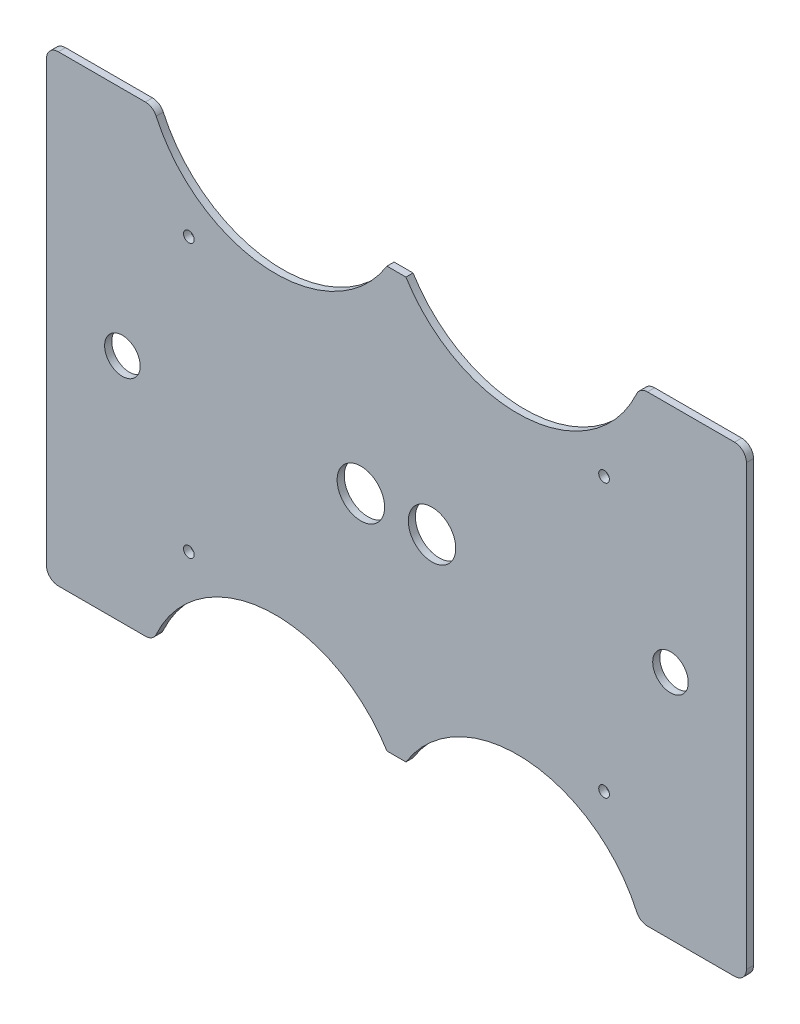
ISO-10303-21;
HEADER;
FILE_DESCRIPTION(('STEP AP214'),'2;1');
FILE_NAME('part.step','',(''),(''),'','','');
FILE_SCHEMA(('AUTOMOTIVE_DESIGN { 1 0 10303 214 1 1 1 1 }'));
ENDSEC;
DATA;
#1=APPLICATION_CONTEXT('core data for automotive mechanical design processes');
#2=APPLICATION_PROTOCOL_DEFINITION('international standard','automotive_design',2000,#1);
#3=PRODUCT_CONTEXT('',#1,'mechanical');
#4=PRODUCT('Part','Part','',(#3));
#5=PRODUCT_RELATED_PRODUCT_CATEGORY('part','',(#4));
#6=PRODUCT_DEFINITION_FORMATION('','',#4);
#7=PRODUCT_DEFINITION_CONTEXT('part definition',#1,'design');
#8=PRODUCT_DEFINITION('design','',#6,#7);
#9=PRODUCT_DEFINITION_SHAPE('','',#8);
#10=(LENGTH_UNIT() NAMED_UNIT(*) SI_UNIT(.MILLI.,.METRE.));
#11=(NAMED_UNIT(*) PLANE_ANGLE_UNIT() SI_UNIT($,.RADIAN.));
#12=(NAMED_UNIT(*) SI_UNIT($,.STERADIAN.) SOLID_ANGLE_UNIT());
#13=UNCERTAINTY_MEASURE_WITH_UNIT(LENGTH_MEASURE(1.E-05),#10,'distance_accuracy_value','');
#14=(GEOMETRIC_REPRESENTATION_CONTEXT(3) GLOBAL_UNCERTAINTY_ASSIGNED_CONTEXT((#13)) GLOBAL_UNIT_ASSIGNED_CONTEXT((#10,
#11,#12)) REPRESENTATION_CONTEXT('',''));
#15=CARTESIAN_POINT('',(0.,0.,0.));
#16=DIRECTION('',(0.,0.,1.));
#17=DIRECTION('',(1.,0.,0.));
#18=AXIS2_PLACEMENT_3D('',#15,#16,#17);
#19=CARTESIAN_POINT('',(198.511421319797,-215.,3.));
#20=DIRECTION('',(0.,0.,-1.));
#21=DIRECTION('',(-1.,0.,0.));
#22=AXIS2_PLACEMENT_3D('',#19,#20,#21);
#23=PLANE('',#22);
#24=CARTESIAN_POINT('',(235.,-155.,3.));
#25=DIRECTION('',(0.,0.,1.));
#26=DIRECTION('',(1.,0.,0.));
#27=AXIS2_PLACEMENT_3D('',#24,#25,#26);
#28=CIRCLE('',#27,2.25000000000001);
#29=CARTESIAN_POINT('',(237.25,-155.,3.));
#30=VERTEX_POINT('',#29);
#31=EDGE_CURVE('E409',#30,#30,#28,.T.);
#32=ORIENTED_EDGE('',*,*,#31,.F.);
#33=EDGE_LOOP('',(#32));
#34=FACE_BOUND('',#33,.T.);
#35=CARTESIAN_POINT('',(162.5,-97.5,3.));
#36=DIRECTION('',(0.,0.,1.));
#37=DIRECTION('',(-1.,0.,0.));
#38=AXIS2_PLACEMENT_3D('',#35,#36,#37);
#39=CIRCLE('',#38,10.);
#40=CARTESIAN_POINT('',(152.5,-97.5,3.));
#41=VERTEX_POINT('',#40);
#42=EDGE_CURVE('E421',#41,#41,#39,.T.);
#43=ORIENTED_EDGE('',*,*,#42,.F.);
#44=EDGE_LOOP('',(#43));
#45=FACE_BOUND('',#44,.T.);
#46=CARTESIAN_POINT('',(263.,-97.5,3.));
#47=DIRECTION('',(0.,0.,1.));
#48=DIRECTION('',(-1.,0.,0.));
#49=AXIS2_PLACEMENT_3D('',#46,#47,#48);
#50=CIRCLE('',#49,7.50000000000001);
#51=CARTESIAN_POINT('',(255.5,-97.5,3.));
#52=VERTEX_POINT('',#51);
#53=EDGE_CURVE('E433',#52,#52,#50,.T.);
#54=ORIENTED_EDGE('',*,*,#53,.F.);
#55=EDGE_LOOP('',(#54));
#56=FACE_BOUND('',#55,.T.);
#57=CARTESIAN_POINT('',(60.,-40.,3.));
#58=DIRECTION('',(0.,0.,1.));
#59=DIRECTION('',(1.,0.,0.));
#60=AXIS2_PLACEMENT_3D('',#57,#58,#59);
#61=CIRCLE('',#60,2.25);
#62=CARTESIAN_POINT('',(62.25,-40.,3.));
#63=VERTEX_POINT('',#62);
#64=EDGE_CURVE('E203',#63,#63,#61,.T.);
#65=ORIENTED_EDGE('',*,*,#64,.F.);
#66=EDGE_LOOP('',(#65));
#67=FACE_BOUND('',#66,.T.);
#68=CARTESIAN_POINT('',(198.511421319797,-215.,3.));
#69=DIRECTION('',(0.,0.,-1.));
#70=DIRECTION('',(-1.,0.,0.));
#71=AXIS2_PLACEMENT_3D('',#68,#69,#70);
#72=CIRCLE('',#71,55.2365253659882);
#73=CARTESIAN_POINT('',(151.5,-186.,3.));
#74=VERTEX_POINT('',#73);
#75=CARTESIAN_POINT('',(248.766024290285,-192.075152895034,3.));
#76=VERTEX_POINT('',#75);
#77=EDGE_CURVE('E238',#74,#76,#72,.T.);
#78=ORIENTED_EDGE('',*,*,#77,.T.);
#79=CARTESIAN_POINT('',(253.315061601874,-190.,3.));
#80=DIRECTION('',(0.,0.,1.));
#81=DIRECTION('',(1.,0.,0.));
#82=AXIS2_PLACEMENT_3D('',#79,#80,#81);
#83=CIRCLE('',#82,5.);
#84=CARTESIAN_POINT('',(253.315061601874,-195.,3.));
#85=VERTEX_POINT('',#84);
#86=EDGE_CURVE('E126',#76,#85,#83,.T.);
#87=ORIENTED_EDGE('',*,*,#86,.T.);
#88=DIRECTION('',(1.,0.,0.));
#89=VECTOR('',#88,1.);
#90=CARTESIAN_POINT('',(253.315061601874,-195.,3.));
#91=LINE('',#90,#89);
#92=CARTESIAN_POINT('',(290.,-195.,3.));
#93=VERTEX_POINT('',#92);
#94=EDGE_CURVE('E289',#85,#93,#91,.T.);
#95=ORIENTED_EDGE('',*,*,#94,.T.);
#96=CARTESIAN_POINT('',(290.,-190.,3.));
#97=DIRECTION('',(0.,0.,1.));
#98=DIRECTION('',(1.,0.,0.));
#99=AXIS2_PLACEMENT_3D('',#96,#97,#98);
#100=CIRCLE('',#99,5.);
#101=CARTESIAN_POINT('',(295.,-190.,3.));
#102=VERTEX_POINT('',#101);
#103=EDGE_CURVE('E308',#93,#102,#100,.T.);
#104=ORIENTED_EDGE('',*,*,#103,.T.);
#105=DIRECTION('',(0.,1.,0.));
#106=VECTOR('',#105,1.);
#107=CARTESIAN_POINT('',(295.,-5.00000000000004,3.));
#108=LINE('',#107,#106);
#109=CARTESIAN_POINT('',(295.,-5.00000000000004,3.));
#110=VERTEX_POINT('',#109);
#111=EDGE_CURVE('E305',#102,#110,#108,.T.);
#112=ORIENTED_EDGE('',*,*,#111,.T.);
#113=CARTESIAN_POINT('',(290.,-5.,3.));
#114=DIRECTION('',(0.,0.,1.));
#115=DIRECTION('',(1.,0.,0.));
#116=AXIS2_PLACEMENT_3D('',#113,#114,#115);
#117=CIRCLE('',#116,5.);
#118=CARTESIAN_POINT('',(290.,0.,3.));
#119=VERTEX_POINT('',#118);
#120=EDGE_CURVE('E307',#110,#119,#117,.T.);
#121=ORIENTED_EDGE('',*,*,#120,.T.);
#122=DIRECTION('',(-1.,0.,0.));
#123=VECTOR('',#122,1.);
#124=CARTESIAN_POINT('',(253.315061601874,0.,3.));
#125=LINE('',#124,#123);
#126=CARTESIAN_POINT('',(253.315061601874,0.,3.));
#127=VERTEX_POINT('',#126);
#128=EDGE_CURVE('E310',#119,#127,#125,.T.);
#129=ORIENTED_EDGE('',*,*,#128,.T.);
#130=CARTESIAN_POINT('',(253.315061601874,-5.,3.));
#131=DIRECTION('',(0.,0.,1.));
#132=DIRECTION('',(-1.,0.,0.));
#133=AXIS2_PLACEMENT_3D('',#130,#131,#132);
#134=CIRCLE('',#133,5.);
#135=CARTESIAN_POINT('',(248.766024290285,-2.92484710496635,3.));
#136=VERTEX_POINT('',#135);
#137=EDGE_CURVE('E316',#127,#136,#134,.T.);
#138=ORIENTED_EDGE('',*,*,#137,.T.);
#139=CARTESIAN_POINT('',(198.511421319797,20.,3.));
#140=DIRECTION('',(0.,0.,-1.));
#141=DIRECTION('',(1.,0.,0.));
#142=AXIS2_PLACEMENT_3D('',#139,#140,#141);
#143=CIRCLE('',#142,55.2365253659882);
#144=CARTESIAN_POINT('',(151.5,-9.,3.));
#145=VERTEX_POINT('',#144);
#146=EDGE_CURVE('E318',#136,#145,#143,.T.);
#147=ORIENTED_EDGE('',*,*,#146,.T.);
#148=DIRECTION('',(-1.,0.,0.));
#149=VECTOR('',#148,1.);
#150=CARTESIAN_POINT('',(151.5,-9.,3.));
#151=LINE('',#150,#149);
#152=CARTESIAN_POINT('',(143.5,-9.,3.));
#153=VERTEX_POINT('',#152);
#154=EDGE_CURVE('E320',#145,#153,#151,.T.);
#155=ORIENTED_EDGE('',*,*,#154,.T.);
#156=CARTESIAN_POINT('',(96.488578680203,20.,3.));
#157=DIRECTION('',(0.,0.,-1.));
#158=DIRECTION('',(-1.,0.,0.));
#159=AXIS2_PLACEMENT_3D('',#156,#157,#158);
#160=CIRCLE('',#159,55.2365253659882);
#161=CARTESIAN_POINT('',(46.2339757097151,-2.92484710496633,3.));
#162=VERTEX_POINT('',#161);
#163=EDGE_CURVE('E322',#153,#162,#160,.T.);
#164=ORIENTED_EDGE('',*,*,#163,.T.);
#165=CARTESIAN_POINT('',(41.6849383981256,-5.,3.));
#166=DIRECTION('',(0.,0.,1.));
#167=DIRECTION('',(1.,0.,0.));
#168=AXIS2_PLACEMENT_3D('',#165,#166,#167);
#169=CIRCLE('',#168,5.);
#170=CARTESIAN_POINT('',(41.6849383981256,0.,3.));
#171=VERTEX_POINT('',#170);
#172=EDGE_CURVE('E324',#162,#171,#169,.T.);
#173=ORIENTED_EDGE('',*,*,#172,.T.);
#174=DIRECTION('',(-1.,0.,0.));
#175=VECTOR('',#174,1.);
#176=CARTESIAN_POINT('',(5.00000000000004,0.,3.));
#177=LINE('',#176,#175);
#178=CARTESIAN_POINT('',(5.00000000000004,0.,3.));
#179=VERTEX_POINT('',#178);
#180=EDGE_CURVE('E326',#171,#179,#177,.T.);
#181=ORIENTED_EDGE('',*,*,#180,.T.);
#182=CARTESIAN_POINT('',(5.,-5.,3.));
#183=DIRECTION('',(0.,0.,1.));
#184=DIRECTION('',(1.,0.,0.));
#185=AXIS2_PLACEMENT_3D('',#182,#183,#184);
#186=CIRCLE('',#185,5.);
#187=CARTESIAN_POINT('',(0.,-5.00000000000004,3.));
#188=VERTEX_POINT('',#187);
#189=EDGE_CURVE('E328',#179,#188,#186,.T.);
#190=ORIENTED_EDGE('',*,*,#189,.T.);
#191=DIRECTION('',(0.,-1.,0.));
#192=VECTOR('',#191,1.);
#193=CARTESIAN_POINT('',(0.,-5.00000000000004,3.));
#194=LINE('',#193,#192);
#195=CARTESIAN_POINT('',(0.,-190.,3.));
#196=VERTEX_POINT('',#195);
#197=EDGE_CURVE('E330',#188,#196,#194,.T.);
#198=ORIENTED_EDGE('',*,*,#197,.T.);
#199=CARTESIAN_POINT('',(5.00000000000003,-190.,3.));
#200=DIRECTION('',(0.,0.,1.));
#201=DIRECTION('',(1.,0.,0.));
#202=AXIS2_PLACEMENT_3D('',#199,#200,#201);
#203=CIRCLE('',#202,5.);
#204=CARTESIAN_POINT('',(5.00000000000006,-195.,3.));
#205=VERTEX_POINT('',#204);
#206=EDGE_CURVE('E332',#196,#205,#203,.T.);
#207=ORIENTED_EDGE('',*,*,#206,.T.);
#208=DIRECTION('',(1.,0.,0.));
#209=VECTOR('',#208,1.);
#210=CARTESIAN_POINT('',(5.00000000000006,-195.,3.));
#211=LINE('',#210,#209);
#212=CARTESIAN_POINT('',(41.6849383981256,-195.,3.));
#213=VERTEX_POINT('',#212);
#214=EDGE_CURVE('E181',#205,#213,#211,.T.);
#215=ORIENTED_EDGE('',*,*,#214,.T.);
#216=CARTESIAN_POINT('',(41.6849383981256,-190.,3.));
#217=DIRECTION('',(0.,0.,1.));
#218=DIRECTION('',(1.,0.,0.));
#219=AXIS2_PLACEMENT_3D('',#216,#217,#218);
#220=CIRCLE('',#219,5.);
#221=CARTESIAN_POINT('',(46.2339757097151,-192.075152895034,3.));
#222=VERTEX_POINT('',#221);
#223=EDGE_CURVE('E175',#213,#222,#220,.T.);
#224=ORIENTED_EDGE('',*,*,#223,.T.);
#225=CARTESIAN_POINT('',(96.488578680203,-215.,3.));
#226=DIRECTION('',(0.,0.,-1.));
#227=DIRECTION('',(1.,0.,0.));
#228=AXIS2_PLACEMENT_3D('',#225,#226,#227);
#229=CIRCLE('',#228,55.2365253659882);
#230=CARTESIAN_POINT('',(143.5,-186.,3.));
#231=VERTEX_POINT('',#230);
#232=EDGE_CURVE('E179',#222,#231,#229,.T.);
#233=ORIENTED_EDGE('',*,*,#232,.T.);
#234=DIRECTION('',(1.,0.,0.));
#235=VECTOR('',#234,1.);
#236=CARTESIAN_POINT('',(151.5,-186.,3.));
#237=LINE('',#236,#235);
#238=EDGE_CURVE('E47',#231,#74,#237,.T.);
#239=ORIENTED_EDGE('',*,*,#238,.T.);
#240=EDGE_LOOP('',(#78,#87,#95,#104,#112,#121,#129,#138,#147,#155,#164,#173,#181,#190,#198,#207,
#215,#224,#233,#239));
#241=FACE_BOUND('',#240,.T.);
#242=CARTESIAN_POINT('',(32.,-97.5,3.));
#243=DIRECTION('',(0.,0.,1.));
#244=DIRECTION('',(1.,0.,0.));
#245=AXIS2_PLACEMENT_3D('',#242,#243,#244);
#246=CIRCLE('',#245,7.5);
#247=CARTESIAN_POINT('',(39.5,-97.5,3.));
#248=VERTEX_POINT('',#247);
#249=EDGE_CURVE('E439',#248,#248,#246,.T.);
#250=ORIENTED_EDGE('',*,*,#249,.F.);
#251=EDGE_LOOP('',(#250));
#252=FACE_BOUND('',#251,.T.);
#253=CARTESIAN_POINT('',(132.5,-97.5,3.));
#254=DIRECTION('',(0.,0.,1.));
#255=DIRECTION('',(1.,0.,0.));
#256=AXIS2_PLACEMENT_3D('',#253,#254,#255);
#257=CIRCLE('',#256,10.);
#258=CARTESIAN_POINT('',(142.5,-97.5,3.));
#259=VERTEX_POINT('',#258);
#260=EDGE_CURVE('E427',#259,#259,#257,.T.);
#261=ORIENTED_EDGE('',*,*,#260,.F.);
#262=EDGE_LOOP('',(#261));
#263=FACE_BOUND('',#262,.T.);
#264=CARTESIAN_POINT('',(235.,-40.,3.));
#265=DIRECTION('',(0.,0.,1.));
#266=DIRECTION('',(-1.,0.,0.));
#267=AXIS2_PLACEMENT_3D('',#264,#265,#266);
#268=CIRCLE('',#267,2.25000000000001);
#269=CARTESIAN_POINT('',(232.75,-40.,3.));
#270=VERTEX_POINT('',#269);
#271=EDGE_CURVE('E415',#270,#270,#268,.T.);
#272=ORIENTED_EDGE('',*,*,#271,.F.);
#273=EDGE_LOOP('',(#272));
#274=FACE_BOUND('',#273,.T.);
#275=CARTESIAN_POINT('',(60.,-155.,3.));
#276=DIRECTION('',(0.,0.,1.));
#277=DIRECTION('',(-1.,0.,0.));
#278=AXIS2_PLACEMENT_3D('',#275,#276,#277);
#279=CIRCLE('',#278,2.25);
#280=CARTESIAN_POINT('',(57.75,-155.,3.));
#281=VERTEX_POINT('',#280);
#282=EDGE_CURVE('E400',#281,#281,#279,.T.);
#283=ORIENTED_EDGE('',*,*,#282,.F.);
#284=EDGE_LOOP('',(#283));
#285=FACE_BOUND('',#284,.T.);
#286=ADVANCED_FACE('F30',(#34,#45,#56,#67,#241,#252,#263,#274,#285),#23,.F.);
#287=CARTESIAN_POINT('',(198.511421319797,-215.,0.));
#288=DIRECTION('',(0.,0.,-1.));
#289=DIRECTION('',(-1.,0.,0.));
#290=AXIS2_PLACEMENT_3D('',#287,#288,#289);
#291=PLANE('',#290);
#292=CARTESIAN_POINT('',(235.,-155.,0.));
#293=DIRECTION('',(0.,0.,1.));
#294=DIRECTION('',(1.,0.,0.));
#295=AXIS2_PLACEMENT_3D('',#292,#293,#294);
#296=CIRCLE('',#295,2.25000000000001);
#297=CARTESIAN_POINT('',(237.25,-155.,0.));
#298=VERTEX_POINT('',#297);
#299=EDGE_CURVE('E406',#298,#298,#296,.T.);
#300=ORIENTED_EDGE('',*,*,#299,.T.);
#301=EDGE_LOOP('',(#300));
#302=FACE_BOUND('',#301,.T.);
#303=CARTESIAN_POINT('',(162.5,-97.5,0.));
#304=DIRECTION('',(0.,0.,1.));
#305=DIRECTION('',(-1.,0.,0.));
#306=AXIS2_PLACEMENT_3D('',#303,#304,#305);
#307=CIRCLE('',#306,10.);
#308=CARTESIAN_POINT('',(152.5,-97.5,0.));
#309=VERTEX_POINT('',#308);
#310=EDGE_CURVE('E418',#309,#309,#307,.T.);
#311=ORIENTED_EDGE('',*,*,#310,.T.);
#312=EDGE_LOOP('',(#311));
#313=FACE_BOUND('',#312,.T.);
#314=CARTESIAN_POINT('',(263.,-97.5,0.));
#315=DIRECTION('',(0.,0.,1.));
#316=DIRECTION('',(-1.,0.,0.));
#317=AXIS2_PLACEMENT_3D('',#314,#315,#316);
#318=CIRCLE('',#317,7.50000000000001);
#319=CARTESIAN_POINT('',(255.5,-97.5,0.));
#320=VERTEX_POINT('',#319);
#321=EDGE_CURVE('E430',#320,#320,#318,.T.);
#322=ORIENTED_EDGE('',*,*,#321,.T.);
#323=EDGE_LOOP('',(#322));
#324=FACE_BOUND('',#323,.T.);
#325=CARTESIAN_POINT('',(60.,-40.,0.));
#326=DIRECTION('',(0.,0.,1.));
#327=DIRECTION('',(1.,0.,0.));
#328=AXIS2_PLACEMENT_3D('',#325,#326,#327);
#329=CIRCLE('',#328,2.25);
#330=CARTESIAN_POINT('',(62.25,-40.,0.));
#331=VERTEX_POINT('',#330);
#332=EDGE_CURVE('E442',#331,#331,#329,.T.);
#333=ORIENTED_EDGE('',*,*,#332,.T.);
#334=EDGE_LOOP('',(#333));
#335=FACE_BOUND('',#334,.T.);
#336=CARTESIAN_POINT('',(198.511421319797,-215.,0.));
#337=DIRECTION('',(0.,0.,-1.));
#338=DIRECTION('',(-1.,0.,0.));
#339=AXIS2_PLACEMENT_3D('',#336,#337,#338);
#340=CIRCLE('',#339,55.2365253659882);
#341=CARTESIAN_POINT('',(151.5,-186.,0.));
#342=VERTEX_POINT('',#341);
#343=CARTESIAN_POINT('',(248.766024290285,-192.075152895034,0.));
#344=VERTEX_POINT('',#343);
#345=EDGE_CURVE('E199',#342,#344,#340,.T.);
#346=ORIENTED_EDGE('',*,*,#345,.F.);
#347=DIRECTION('',(1.,0.,0.));
#348=VECTOR('',#347,1.);
#349=CARTESIAN_POINT('',(151.5,-186.,0.));
#350=LINE('',#349,#348);
#351=CARTESIAN_POINT('',(143.5,-186.,0.));
#352=VERTEX_POINT('',#351);
#353=EDGE_CURVE('E118',#352,#342,#350,.T.);
#354=ORIENTED_EDGE('',*,*,#353,.F.);
#355=CARTESIAN_POINT('',(96.488578680203,-215.,0.));
#356=DIRECTION('',(0.,0.,-1.));
#357=DIRECTION('',(1.,0.,0.));
#358=AXIS2_PLACEMENT_3D('',#355,#356,#357);
#359=CIRCLE('',#358,55.2365253659882);
#360=CARTESIAN_POINT('',(46.2339757097151,-192.075152895034,0.));
#361=VERTEX_POINT('',#360);
#362=EDGE_CURVE('E112',#361,#352,#359,.T.);
#363=ORIENTED_EDGE('',*,*,#362,.F.);
#364=CARTESIAN_POINT('',(41.6849383981256,-190.,0.));
#365=DIRECTION('',(0.,0.,1.));
#366=DIRECTION('',(1.,0.,0.));
#367=AXIS2_PLACEMENT_3D('',#364,#365,#366);
#368=CIRCLE('',#367,5.);
#369=CARTESIAN_POINT('',(41.6849383981256,-195.,0.));
#370=VERTEX_POINT('',#369);
#371=EDGE_CURVE('E189',#370,#361,#368,.T.);
#372=ORIENTED_EDGE('',*,*,#371,.F.);
#373=DIRECTION('',(1.,0.,0.));
#374=VECTOR('',#373,1.);
#375=CARTESIAN_POINT('',(5.00000000000006,-195.,0.));
#376=LINE('',#375,#374);
#377=CARTESIAN_POINT('',(5.00000000000006,-195.,0.));
#378=VERTEX_POINT('',#377);
#379=EDGE_CURVE('E233',#378,#370,#376,.T.);
#380=ORIENTED_EDGE('',*,*,#379,.F.);
#381=CARTESIAN_POINT('',(5.00000000000003,-190.,0.));
#382=DIRECTION('',(0.,0.,1.));
#383=DIRECTION('',(1.,0.,0.));
#384=AXIS2_PLACEMENT_3D('',#381,#382,#383);
#385=CIRCLE('',#384,5.);
#386=CARTESIAN_POINT('',(0.,-190.,0.));
#387=VERTEX_POINT('',#386);
#388=EDGE_CURVE('E231',#387,#378,#385,.T.);
#389=ORIENTED_EDGE('',*,*,#388,.F.);
#390=DIRECTION('',(0.,-1.,0.));
#391=VECTOR('',#390,1.);
#392=CARTESIAN_POINT('',(0.,-5.00000000000004,0.));
#393=LINE('',#392,#391);
#394=CARTESIAN_POINT('',(0.,-5.00000000000004,0.));
#395=VERTEX_POINT('',#394);
#396=EDGE_CURVE('E229',#395,#387,#393,.T.);
#397=ORIENTED_EDGE('',*,*,#396,.F.);
#398=CARTESIAN_POINT('',(5.,-5.,0.));
#399=DIRECTION('',(0.,0.,1.));
#400=DIRECTION('',(1.,0.,0.));
#401=AXIS2_PLACEMENT_3D('',#398,#399,#400);
#402=CIRCLE('',#401,5.);
#403=CARTESIAN_POINT('',(5.00000000000004,0.,0.));
#404=VERTEX_POINT('',#403);
#405=EDGE_CURVE('E227',#404,#395,#402,.T.);
#406=ORIENTED_EDGE('',*,*,#405,.F.);
#407=DIRECTION('',(-1.,0.,0.));
#408=VECTOR('',#407,1.);
#409=CARTESIAN_POINT('',(5.00000000000004,0.,0.));
#410=LINE('',#409,#408);
#411=CARTESIAN_POINT('',(41.6849383981256,0.,0.));
#412=VERTEX_POINT('',#411);
#413=EDGE_CURVE('E225',#412,#404,#410,.T.);
#414=ORIENTED_EDGE('',*,*,#413,.F.);
#415=CARTESIAN_POINT('',(41.6849383981256,-5.,0.));
#416=DIRECTION('',(0.,0.,1.));
#417=DIRECTION('',(1.,0.,0.));
#418=AXIS2_PLACEMENT_3D('',#415,#416,#417);
#419=CIRCLE('',#418,5.);
#420=CARTESIAN_POINT('',(46.2339757097151,-2.92484710496633,0.));
#421=VERTEX_POINT('',#420);
#422=EDGE_CURVE('E223',#421,#412,#419,.T.);
#423=ORIENTED_EDGE('',*,*,#422,.F.);
#424=CARTESIAN_POINT('',(96.488578680203,20.,0.));
#425=DIRECTION('',(0.,0.,-1.));
#426=DIRECTION('',(-1.,0.,0.));
#427=AXIS2_PLACEMENT_3D('',#424,#425,#426);
#428=CIRCLE('',#427,55.2365253659882);
#429=CARTESIAN_POINT('',(143.5,-9.,0.));
#430=VERTEX_POINT('',#429);
#431=EDGE_CURVE('E221',#430,#421,#428,.T.);
#432=ORIENTED_EDGE('',*,*,#431,.F.);
#433=DIRECTION('',(-1.,0.,0.));
#434=VECTOR('',#433,1.);
#435=CARTESIAN_POINT('',(151.5,-9.,0.));
#436=LINE('',#435,#434);
#437=CARTESIAN_POINT('',(151.5,-9.,0.));
#438=VERTEX_POINT('',#437);
#439=EDGE_CURVE('E219',#438,#430,#436,.T.);
#440=ORIENTED_EDGE('',*,*,#439,.F.);
#441=CARTESIAN_POINT('',(198.511421319797,20.,0.));
#442=DIRECTION('',(0.,0.,-1.));
#443=DIRECTION('',(1.,0.,0.));
#444=AXIS2_PLACEMENT_3D('',#441,#442,#443);
#445=CIRCLE('',#444,55.2365253659882);
#446=CARTESIAN_POINT('',(248.766024290285,-2.92484710496635,0.));
#447=VERTEX_POINT('',#446);
#448=EDGE_CURVE('E217',#447,#438,#445,.T.);
#449=ORIENTED_EDGE('',*,*,#448,.F.);
#450=CARTESIAN_POINT('',(253.315061601874,-5.,0.));
#451=DIRECTION('',(0.,0.,1.));
#452=DIRECTION('',(-1.,0.,0.));
#453=AXIS2_PLACEMENT_3D('',#450,#451,#452);
#454=CIRCLE('',#453,5.);
#455=CARTESIAN_POINT('',(253.315061601874,0.,0.));
#456=VERTEX_POINT('',#455);
#457=EDGE_CURVE('E215',#456,#447,#454,.T.);
#458=ORIENTED_EDGE('',*,*,#457,.F.);
#459=DIRECTION('',(-1.,0.,0.));
#460=VECTOR('',#459,1.);
#461=CARTESIAN_POINT('',(253.315061601874,0.,0.));
#462=LINE('',#461,#460);
#463=CARTESIAN_POINT('',(290.,0.,0.));
#464=VERTEX_POINT('',#463);
#465=EDGE_CURVE('E213',#464,#456,#462,.T.);
#466=ORIENTED_EDGE('',*,*,#465,.F.);
#467=CARTESIAN_POINT('',(290.,-5.,0.));
#468=DIRECTION('',(0.,0.,1.));
#469=DIRECTION('',(1.,0.,0.));
#470=AXIS2_PLACEMENT_3D('',#467,#468,#469);
#471=CIRCLE('',#470,5.);
#472=CARTESIAN_POINT('',(295.,-5.00000000000004,0.));
#473=VERTEX_POINT('',#472);
#474=EDGE_CURVE('E211',#473,#464,#471,.T.);
#475=ORIENTED_EDGE('',*,*,#474,.F.);
#476=DIRECTION('',(0.,1.,0.));
#477=VECTOR('',#476,1.);
#478=CARTESIAN_POINT('',(295.,-5.00000000000004,0.));
#479=LINE('',#478,#477);
#480=CARTESIAN_POINT('',(295.,-190.,0.));
#481=VERTEX_POINT('',#480);
#482=EDGE_CURVE('E209',#481,#473,#479,.T.);
#483=ORIENTED_EDGE('',*,*,#482,.F.);
#484=CARTESIAN_POINT('',(290.,-190.,0.));
#485=DIRECTION('',(0.,0.,1.));
#486=DIRECTION('',(1.,0.,0.));
#487=AXIS2_PLACEMENT_3D('',#484,#485,#486);
#488=CIRCLE('',#487,5.);
#489=CARTESIAN_POINT('',(290.,-195.,0.));
#490=VERTEX_POINT('',#489);
#491=EDGE_CURVE('E207',#490,#481,#488,.T.);
#492=ORIENTED_EDGE('',*,*,#491,.F.);
#493=DIRECTION('',(1.,0.,0.));
#494=VECTOR('',#493,1.);
#495=CARTESIAN_POINT('',(253.315061601874,-195.,0.));
#496=LINE('',#495,#494);
#497=CARTESIAN_POINT('',(253.315061601874,-195.,0.));
#498=VERTEX_POINT('',#497);
#499=EDGE_CURVE('E205',#498,#490,#496,.T.);
#500=ORIENTED_EDGE('',*,*,#499,.F.);
#501=CARTESIAN_POINT('',(253.315061601874,-190.,0.));
#502=DIRECTION('',(0.,0.,1.));
#503=DIRECTION('',(1.,0.,0.));
#504=AXIS2_PLACEMENT_3D('',#501,#502,#503);
#505=CIRCLE('',#504,5.);
#506=EDGE_CURVE('E202',#344,#498,#505,.T.);
#507=ORIENTED_EDGE('',*,*,#506,.F.);
#508=EDGE_LOOP('',(#346,#354,#363,#372,#380,#389,#397,#406,#414,#423,#432,#440,#449,#458,#466,
#475,#483,#492,#500,#507));
#509=FACE_BOUND('',#508,.T.);
#510=CARTESIAN_POINT('',(32.,-97.5,0.));
#511=DIRECTION('',(0.,0.,1.));
#512=DIRECTION('',(1.,0.,0.));
#513=AXIS2_PLACEMENT_3D('',#510,#511,#512);
#514=CIRCLE('',#513,7.5);
#515=CARTESIAN_POINT('',(39.5,-97.5,0.));
#516=VERTEX_POINT('',#515);
#517=EDGE_CURVE('E436',#516,#516,#514,.T.);
#518=ORIENTED_EDGE('',*,*,#517,.T.);
#519=EDGE_LOOP('',(#518));
#520=FACE_BOUND('',#519,.T.);
#521=CARTESIAN_POINT('',(132.5,-97.5,0.));
#522=DIRECTION('',(0.,0.,1.));
#523=DIRECTION('',(1.,0.,0.));
#524=AXIS2_PLACEMENT_3D('',#521,#522,#523);
#525=CIRCLE('',#524,10.);
#526=CARTESIAN_POINT('',(142.5,-97.5,0.));
#527=VERTEX_POINT('',#526);
#528=EDGE_CURVE('E424',#527,#527,#525,.T.);
#529=ORIENTED_EDGE('',*,*,#528,.T.);
#530=EDGE_LOOP('',(#529));
#531=FACE_BOUND('',#530,.T.);
#532=CARTESIAN_POINT('',(235.,-40.,0.));
#533=DIRECTION('',(0.,0.,1.));
#534=DIRECTION('',(-1.,0.,0.));
#535=AXIS2_PLACEMENT_3D('',#532,#533,#534);
#536=CIRCLE('',#535,2.25000000000001);
#537=CARTESIAN_POINT('',(232.75,-40.,0.));
#538=VERTEX_POINT('',#537);
#539=EDGE_CURVE('E412',#538,#538,#536,.T.);
#540=ORIENTED_EDGE('',*,*,#539,.T.);
#541=EDGE_LOOP('',(#540));
#542=FACE_BOUND('',#541,.T.);
#543=CARTESIAN_POINT('',(60.,-155.,0.));
#544=DIRECTION('',(0.,0.,1.));
#545=DIRECTION('',(-1.,0.,0.));
#546=AXIS2_PLACEMENT_3D('',#543,#544,#545);
#547=CIRCLE('',#546,2.25);
#548=CARTESIAN_POINT('',(57.75,-155.,0.));
#549=VERTEX_POINT('',#548);
#550=EDGE_CURVE('E403',#549,#549,#547,.T.);
#551=ORIENTED_EDGE('',*,*,#550,.T.);
#552=EDGE_LOOP('',(#551));
#553=FACE_BOUND('',#552,.T.);
#554=ADVANCED_FACE('F293',(#302,#313,#324,#335,#509,#520,#531,#542,#553),#291,.T.);
#555=CARTESIAN_POINT('',(198.511421319797,-215.,3.));
#556=DIRECTION('',(0.,0.,-1.));
#557=DIRECTION('',(-1.,0.,0.));
#558=AXIS2_PLACEMENT_3D('',#555,#556,#557);
#559=CYLINDRICAL_SURFACE('',#558,55.2365253659882);
#560=ORIENTED_EDGE('',*,*,#345,.T.);
#561=DIRECTION('',(0.,0.,-1.));
#562=VECTOR('',#561,1.);
#563=CARTESIAN_POINT('',(248.766024290285,-192.075152895034,3.));
#564=LINE('',#563,#562);
#565=EDGE_CURVE('E11',#76,#344,#564,.T.);
#566=ORIENTED_EDGE('',*,*,#565,.F.);
#567=ORIENTED_EDGE('',*,*,#77,.F.);
#568=DIRECTION('',(0.,0.,-1.));
#569=VECTOR('',#568,1.);
#570=CARTESIAN_POINT('',(151.5,-186.,3.));
#571=LINE('',#570,#569);
#572=EDGE_CURVE('E195',#74,#342,#571,.T.);
#573=ORIENTED_EDGE('',*,*,#572,.T.);
#574=EDGE_LOOP('',(#560,#566,#567,#573));
#575=FACE_BOUND('',#574,.T.);
#576=ADVANCED_FACE('F32',(#575),#559,.F.);
#577=CARTESIAN_POINT('',(253.315061601874,-190.,3.));
#578=DIRECTION('',(0.,0.,-1.));
#579=DIRECTION('',(-1.,0.,0.));
#580=AXIS2_PLACEMENT_3D('',#577,#578,#579);
#581=CYLINDRICAL_SURFACE('',#580,5.);
#582=ORIENTED_EDGE('',*,*,#506,.T.);
#583=DIRECTION('',(0.,0.,-1.));
#584=VECTOR('',#583,1.);
#585=CARTESIAN_POINT('',(253.315061601874,-195.,3.));
#586=LINE('',#585,#584);
#587=EDGE_CURVE('E39',#85,#498,#586,.T.);
#588=ORIENTED_EDGE('',*,*,#587,.F.);
#589=ORIENTED_EDGE('',*,*,#86,.F.);
#590=ORIENTED_EDGE('',*,*,#565,.T.);
#591=EDGE_LOOP('',(#582,#588,#589,#590));
#592=FACE_BOUND('',#591,.T.);
#593=ADVANCED_FACE('F667',(#592),#581,.T.);
#594=CARTESIAN_POINT('',(253.315061601874,-195.,3.));
#595=DIRECTION('',(0.,1.,0.));
#596=DIRECTION('',(0.,0.,1.));
#597=AXIS2_PLACEMENT_3D('',#594,#595,#596);
#598=PLANE('',#597);
#599=ORIENTED_EDGE('',*,*,#499,.T.);
#600=DIRECTION('',(0.,0.,-1.));
#601=VECTOR('',#600,1.);
#602=CARTESIAN_POINT('',(290.,-195.,3.));
#603=LINE('',#602,#601);
#604=EDGE_CURVE('E281',#93,#490,#603,.T.);
#605=ORIENTED_EDGE('',*,*,#604,.F.);
#606=ORIENTED_EDGE('',*,*,#94,.F.);
#607=ORIENTED_EDGE('',*,*,#587,.T.);
#608=EDGE_LOOP('',(#599,#605,#606,#607));
#609=FACE_BOUND('',#608,.T.);
#610=ADVANCED_FACE('F287',(#609),#598,.F.);
#611=CARTESIAN_POINT('',(290.,-190.,3.));
#612=DIRECTION('',(0.,0.,-1.));
#613=DIRECTION('',(-1.,0.,0.));
#614=AXIS2_PLACEMENT_3D('',#611,#612,#613);
#615=CYLINDRICAL_SURFACE('',#614,5.);
#616=ORIENTED_EDGE('',*,*,#491,.T.);
#617=DIRECTION('',(0.,0.,-1.));
#618=VECTOR('',#617,1.);
#619=CARTESIAN_POINT('',(295.,-190.,3.));
#620=LINE('',#619,#618);
#621=EDGE_CURVE('E278',#102,#481,#620,.T.);
#622=ORIENTED_EDGE('',*,*,#621,.F.);
#623=ORIENTED_EDGE('',*,*,#103,.F.);
#624=ORIENTED_EDGE('',*,*,#604,.T.);
#625=EDGE_LOOP('',(#616,#622,#623,#624));
#626=FACE_BOUND('',#625,.T.);
#627=ADVANCED_FACE('F299',(#626),#615,.T.);
#628=CARTESIAN_POINT('',(295.,-5.00000000000004,3.));
#629=DIRECTION('',(-1.,0.,0.));
#630=DIRECTION('',(0.,0.,1.));
#631=AXIS2_PLACEMENT_3D('',#628,#629,#630);
#632=PLANE('',#631);
#633=ORIENTED_EDGE('',*,*,#482,.T.);
#634=DIRECTION('',(0.,0.,-1.));
#635=VECTOR('',#634,1.);
#636=CARTESIAN_POINT('',(295.,-5.00000000000004,3.));
#637=LINE('',#636,#635);
#638=EDGE_CURVE('E275',#110,#473,#637,.T.);
#639=ORIENTED_EDGE('',*,*,#638,.F.);
#640=ORIENTED_EDGE('',*,*,#111,.F.);
#641=ORIENTED_EDGE('',*,*,#621,.T.);
#642=EDGE_LOOP('',(#633,#639,#640,#641));
#643=FACE_BOUND('',#642,.T.);
#644=ADVANCED_FACE('F303',(#643),#632,.F.);
#645=CARTESIAN_POINT('',(290.,-5.,3.));
#646=DIRECTION('',(0.,0.,-1.));
#647=DIRECTION('',(-1.,0.,0.));
#648=AXIS2_PLACEMENT_3D('',#645,#646,#647);
#649=CYLINDRICAL_SURFACE('',#648,5.);
#650=ORIENTED_EDGE('',*,*,#474,.T.);
#651=DIRECTION('',(0.,0.,-1.));
#652=VECTOR('',#651,1.);
#653=CARTESIAN_POINT('',(290.,0.,3.));
#654=LINE('',#653,#652);
#655=EDGE_CURVE('E272',#119,#464,#654,.T.);
#656=ORIENTED_EDGE('',*,*,#655,.F.);
#657=ORIENTED_EDGE('',*,*,#120,.F.);
#658=ORIENTED_EDGE('',*,*,#638,.T.);
#659=EDGE_LOOP('',(#650,#656,#657,#658));
#660=FACE_BOUND('',#659,.T.);
#661=ADVANCED_FACE('F632',(#660),#649,.T.);
#662=CARTESIAN_POINT('',(253.315061601874,0.,3.));
#663=DIRECTION('',(0.,-1.,0.));
#664=DIRECTION('',(0.,0.,-1.));
#665=AXIS2_PLACEMENT_3D('',#662,#663,#664);
#666=PLANE('',#665);
#667=ORIENTED_EDGE('',*,*,#465,.T.);
#668=DIRECTION('',(0.,0.,-1.));
#669=VECTOR('',#668,1.);
#670=CARTESIAN_POINT('',(253.315061601874,0.,3.));
#671=LINE('',#670,#669);
#672=EDGE_CURVE('E269',#127,#456,#671,.T.);
#673=ORIENTED_EDGE('',*,*,#672,.F.);
#674=ORIENTED_EDGE('',*,*,#128,.F.);
#675=ORIENTED_EDGE('',*,*,#655,.T.);
#676=EDGE_LOOP('',(#667,#673,#674,#675));
#677=FACE_BOUND('',#676,.T.);
#678=ADVANCED_FACE('F622',(#677),#666,.F.);
#679=CARTESIAN_POINT('',(253.315061601874,-5.,3.));
#680=DIRECTION('',(0.,0.,-1.));
#681=DIRECTION('',(-1.,0.,0.));
#682=AXIS2_PLACEMENT_3D('',#679,#680,#681);
#683=CYLINDRICAL_SURFACE('',#682,5.);
#684=ORIENTED_EDGE('',*,*,#457,.T.);
#685=DIRECTION('',(0.,0.,-1.));
#686=VECTOR('',#685,1.);
#687=CARTESIAN_POINT('',(248.766024290285,-2.92484710496635,3.));
#688=LINE('',#687,#686);
#689=EDGE_CURVE('E266',#136,#447,#688,.T.);
#690=ORIENTED_EDGE('',*,*,#689,.F.);
#691=ORIENTED_EDGE('',*,*,#137,.F.);
#692=ORIENTED_EDGE('',*,*,#672,.T.);
#693=EDGE_LOOP('',(#684,#690,#691,#692));
#694=FACE_BOUND('',#693,.T.);
#695=ADVANCED_FACE('F612',(#694),#683,.T.);
#696=CARTESIAN_POINT('',(198.511421319797,20.,3.));
#697=DIRECTION('',(0.,0.,-1.));
#698=DIRECTION('',(-1.,0.,0.));
#699=AXIS2_PLACEMENT_3D('',#696,#697,#698);
#700=CYLINDRICAL_SURFACE('',#699,55.2365253659882);
#701=ORIENTED_EDGE('',*,*,#448,.T.);
#702=DIRECTION('',(0.,0.,-1.));
#703=VECTOR('',#702,1.);
#704=CARTESIAN_POINT('',(151.5,-9.,3.));
#705=LINE('',#704,#703);
#706=EDGE_CURVE('E263',#145,#438,#705,.T.);
#707=ORIENTED_EDGE('',*,*,#706,.F.);
#708=ORIENTED_EDGE('',*,*,#146,.F.);
#709=ORIENTED_EDGE('',*,*,#689,.T.);
#710=EDGE_LOOP('',(#701,#707,#708,#709));
#711=FACE_BOUND('',#710,.T.);
#712=ADVANCED_FACE('F602',(#711),#700,.F.);
#713=CARTESIAN_POINT('',(151.5,-9.,3.));
#714=DIRECTION('',(0.,-1.,0.));
#715=DIRECTION('',(0.,0.,-1.));
#716=AXIS2_PLACEMENT_3D('',#713,#714,#715);
#717=PLANE('',#716);
#718=ORIENTED_EDGE('',*,*,#439,.T.);
#719=DIRECTION('',(0.,0.,-1.));
#720=VECTOR('',#719,1.);
#721=CARTESIAN_POINT('',(143.5,-9.,3.));
#722=LINE('',#721,#720);
#723=EDGE_CURVE('E260',#153,#430,#722,.T.);
#724=ORIENTED_EDGE('',*,*,#723,.F.);
#725=ORIENTED_EDGE('',*,*,#154,.F.);
#726=ORIENTED_EDGE('',*,*,#706,.T.);
#727=EDGE_LOOP('',(#718,#724,#725,#726));
#728=FACE_BOUND('',#727,.T.);
#729=ADVANCED_FACE('F592',(#728),#717,.F.);
#730=CARTESIAN_POINT('',(96.488578680203,20.,3.));
#731=DIRECTION('',(0.,0.,-1.));
#732=DIRECTION('',(-1.,0.,0.));
#733=AXIS2_PLACEMENT_3D('',#730,#731,#732);
#734=CYLINDRICAL_SURFACE('',#733,55.2365253659882);
#735=ORIENTED_EDGE('',*,*,#431,.T.);
#736=DIRECTION('',(0.,0.,-1.));
#737=VECTOR('',#736,1.);
#738=CARTESIAN_POINT('',(46.2339757097151,-2.92484710496633,3.));
#739=LINE('',#738,#737);
#740=EDGE_CURVE('E257',#162,#421,#739,.T.);
#741=ORIENTED_EDGE('',*,*,#740,.F.);
#742=ORIENTED_EDGE('',*,*,#163,.F.);
#743=ORIENTED_EDGE('',*,*,#723,.T.);
#744=EDGE_LOOP('',(#735,#741,#742,#743));
#745=FACE_BOUND('',#744,.T.);
#746=ADVANCED_FACE('F582',(#745),#734,.F.);
#747=CARTESIAN_POINT('',(41.6849383981256,-5.,3.));
#748=DIRECTION('',(0.,0.,-1.));
#749=DIRECTION('',(-1.,0.,0.));
#750=AXIS2_PLACEMENT_3D('',#747,#748,#749);
#751=CYLINDRICAL_SURFACE('',#750,5.);
#752=ORIENTED_EDGE('',*,*,#422,.T.);
#753=DIRECTION('',(0.,0.,-1.));
#754=VECTOR('',#753,1.);
#755=CARTESIAN_POINT('',(41.6849383981256,0.,3.));
#756=LINE('',#755,#754);
#757=EDGE_CURVE('E254',#171,#412,#756,.T.);
#758=ORIENTED_EDGE('',*,*,#757,.F.);
#759=ORIENTED_EDGE('',*,*,#172,.F.);
#760=ORIENTED_EDGE('',*,*,#740,.T.);
#761=EDGE_LOOP('',(#752,#758,#759,#760));
#762=FACE_BOUND('',#761,.T.);
#763=ADVANCED_FACE('F572',(#762),#751,.T.);
#764=CARTESIAN_POINT('',(5.00000000000004,0.,3.));
#765=DIRECTION('',(0.,-1.,0.));
#766=DIRECTION('',(0.,0.,-1.));
#767=AXIS2_PLACEMENT_3D('',#764,#765,#766);
#768=PLANE('',#767);
#769=ORIENTED_EDGE('',*,*,#413,.T.);
#770=DIRECTION('',(0.,0.,-1.));
#771=VECTOR('',#770,1.);
#772=CARTESIAN_POINT('',(5.00000000000004,0.,3.));
#773=LINE('',#772,#771);
#774=EDGE_CURVE('E251',#179,#404,#773,.T.);
#775=ORIENTED_EDGE('',*,*,#774,.F.);
#776=ORIENTED_EDGE('',*,*,#180,.F.);
#777=ORIENTED_EDGE('',*,*,#757,.T.);
#778=EDGE_LOOP('',(#769,#775,#776,#777));
#779=FACE_BOUND('',#778,.T.);
#780=ADVANCED_FACE('F562',(#779),#768,.F.);
#781=CARTESIAN_POINT('',(5.,-5.,3.));
#782=DIRECTION('',(0.,0.,-1.));
#783=DIRECTION('',(-1.,0.,0.));
#784=AXIS2_PLACEMENT_3D('',#781,#782,#783);
#785=CYLINDRICAL_SURFACE('',#784,5.);
#786=ORIENTED_EDGE('',*,*,#405,.T.);
#787=DIRECTION('',(0.,0.,-1.));
#788=VECTOR('',#787,1.);
#789=CARTESIAN_POINT('',(0.,-5.00000000000004,3.));
#790=LINE('',#789,#788);
#791=EDGE_CURVE('E248',#188,#395,#790,.T.);
#792=ORIENTED_EDGE('',*,*,#791,.F.);
#793=ORIENTED_EDGE('',*,*,#189,.F.);
#794=ORIENTED_EDGE('',*,*,#774,.T.);
#795=EDGE_LOOP('',(#786,#792,#793,#794));
#796=FACE_BOUND('',#795,.T.);
#797=ADVANCED_FACE('F552',(#796),#785,.T.);
#798=CARTESIAN_POINT('',(0.,-5.00000000000004,3.));
#799=DIRECTION('',(1.,0.,0.));
#800=DIRECTION('',(0.,1.,0.));
#801=AXIS2_PLACEMENT_3D('',#798,#799,#800);
#802=PLANE('',#801);
#803=ORIENTED_EDGE('',*,*,#396,.T.);
#804=DIRECTION('',(0.,0.,-1.));
#805=VECTOR('',#804,1.);
#806=CARTESIAN_POINT('',(0.,-190.,3.));
#807=LINE('',#806,#805);
#808=EDGE_CURVE('E245',#196,#387,#807,.T.);
#809=ORIENTED_EDGE('',*,*,#808,.F.);
#810=ORIENTED_EDGE('',*,*,#197,.F.);
#811=ORIENTED_EDGE('',*,*,#791,.T.);
#812=EDGE_LOOP('',(#803,#809,#810,#811));
#813=FACE_BOUND('',#812,.T.);
#814=ADVANCED_FACE('F543',(#813),#802,.F.);
#815=CARTESIAN_POINT('',(5.00000000000003,-190.,3.));
#816=DIRECTION('',(0.,0.,-1.));
#817=DIRECTION('',(-1.,0.,0.));
#818=AXIS2_PLACEMENT_3D('',#815,#816,#817);
#819=CYLINDRICAL_SURFACE('',#818,5.);
#820=ORIENTED_EDGE('',*,*,#388,.T.);
#821=DIRECTION('',(0.,0.,-1.));
#822=VECTOR('',#821,1.);
#823=CARTESIAN_POINT('',(5.00000000000006,-195.,3.));
#824=LINE('',#823,#822);
#825=EDGE_CURVE('E242',#205,#378,#824,.T.);
#826=ORIENTED_EDGE('',*,*,#825,.F.);
#827=ORIENTED_EDGE('',*,*,#206,.F.);
#828=ORIENTED_EDGE('',*,*,#808,.T.);
#829=EDGE_LOOP('',(#820,#826,#827,#828));
#830=FACE_BOUND('',#829,.T.);
#831=ADVANCED_FACE('F338',(#830),#819,.T.);
#832=CARTESIAN_POINT('',(5.00000000000006,-195.,3.));
#833=DIRECTION('',(0.,1.,0.));
#834=DIRECTION('',(0.,0.,1.));
#835=AXIS2_PLACEMENT_3D('',#832,#833,#834);
#836=PLANE('',#835);
#837=ORIENTED_EDGE('',*,*,#379,.T.);
#838=DIRECTION('',(0.,0.,-1.));
#839=VECTOR('',#838,1.);
#840=CARTESIAN_POINT('',(41.6849383981256,-195.,3.));
#841=LINE('',#840,#839);
#842=EDGE_CURVE('E190',#213,#370,#841,.T.);
#843=ORIENTED_EDGE('',*,*,#842,.F.);
#844=ORIENTED_EDGE('',*,*,#214,.F.);
#845=ORIENTED_EDGE('',*,*,#825,.T.);
#846=EDGE_LOOP('',(#837,#843,#844,#845));
#847=FACE_BOUND('',#846,.T.);
#848=ADVANCED_FACE('F342',(#847),#836,.F.);
#849=CARTESIAN_POINT('',(41.6849383981256,-190.,3.));
#850=DIRECTION('',(0.,0.,-1.));
#851=DIRECTION('',(-1.,0.,0.));
#852=AXIS2_PLACEMENT_3D('',#849,#850,#851);
#853=CYLINDRICAL_SURFACE('',#852,5.);
#854=ORIENTED_EDGE('',*,*,#371,.T.);
#855=DIRECTION('',(0.,0.,-1.));
#856=VECTOR('',#855,1.);
#857=CARTESIAN_POINT('',(46.2339757097151,-192.075152895034,3.));
#858=LINE('',#857,#856);
#859=EDGE_CURVE('E186',#222,#361,#858,.T.);
#860=ORIENTED_EDGE('',*,*,#859,.F.);
#861=ORIENTED_EDGE('',*,*,#223,.F.);
#862=ORIENTED_EDGE('',*,*,#842,.T.);
#863=EDGE_LOOP('',(#854,#860,#861,#862));
#864=FACE_BOUND('',#863,.T.);
#865=ADVANCED_FACE('F187',(#864),#853,.T.);
#866=CARTESIAN_POINT('',(96.488578680203,-215.,3.));
#867=DIRECTION('',(0.,0.,-1.));
#868=DIRECTION('',(-1.,0.,0.));
#869=AXIS2_PLACEMENT_3D('',#866,#867,#868);
#870=CYLINDRICAL_SURFACE('',#869,55.2365253659882);
#871=ORIENTED_EDGE('',*,*,#362,.T.);
#872=DIRECTION('',(0.,0.,-1.));
#873=VECTOR('',#872,1.);
#874=CARTESIAN_POINT('',(143.5,-186.,3.));
#875=LINE('',#874,#873);
#876=EDGE_CURVE('E191',#231,#352,#875,.T.);
#877=ORIENTED_EDGE('',*,*,#876,.F.);
#878=ORIENTED_EDGE('',*,*,#232,.F.);
#879=ORIENTED_EDGE('',*,*,#859,.T.);
#880=EDGE_LOOP('',(#871,#877,#878,#879));
#881=FACE_BOUND('',#880,.T.);
#882=ADVANCED_FACE('F193',(#881),#870,.F.);
#883=CARTESIAN_POINT('',(151.5,-186.,3.));
#884=DIRECTION('',(0.,1.,0.));
#885=DIRECTION('',(0.,0.,1.));
#886=AXIS2_PLACEMENT_3D('',#883,#884,#885);
#887=PLANE('',#886);
#888=ORIENTED_EDGE('',*,*,#353,.T.);
#889=ORIENTED_EDGE('',*,*,#572,.F.);
#890=ORIENTED_EDGE('',*,*,#238,.F.);
#891=ORIENTED_EDGE('',*,*,#876,.T.);
#892=EDGE_LOOP('',(#888,#889,#890,#891));
#893=FACE_BOUND('',#892,.T.);
#894=ADVANCED_FACE('F346',(#893),#887,.F.);
#895=CARTESIAN_POINT('',(60.,-40.,3.));
#896=DIRECTION('',(0.,0.,-1.));
#897=DIRECTION('',(-1.,0.,0.));
#898=AXIS2_PLACEMENT_3D('',#895,#896,#897);
#899=CYLINDRICAL_SURFACE('',#898,2.25);
#900=ORIENTED_EDGE('',*,*,#64,.T.);
#901=EDGE_LOOP('',(#900));
#902=FACE_BOUND('',#901,.T.);
#903=ORIENTED_EDGE('',*,*,#332,.F.);
#904=EDGE_LOOP('',(#903));
#905=FACE_BOUND('',#904,.T.);
#906=ADVANCED_FACE('F348',(#902,#905),#899,.F.);
#907=CARTESIAN_POINT('',(32.,-97.5,3.));
#908=DIRECTION('',(0.,0.,-1.));
#909=DIRECTION('',(-1.,0.,0.));
#910=AXIS2_PLACEMENT_3D('',#907,#908,#909);
#911=CYLINDRICAL_SURFACE('',#910,7.5);
#912=ORIENTED_EDGE('',*,*,#249,.T.);
#913=EDGE_LOOP('',(#912));
#914=FACE_BOUND('',#913,.T.);
#915=ORIENTED_EDGE('',*,*,#517,.F.);
#916=EDGE_LOOP('',(#915));
#917=FACE_BOUND('',#916,.T.);
#918=ADVANCED_FACE('F354',(#914,#917),#911,.F.);
#919=CARTESIAN_POINT('',(263.,-97.5,3.));
#920=DIRECTION('',(0.,0.,-1.));
#921=DIRECTION('',(-1.,0.,0.));
#922=AXIS2_PLACEMENT_3D('',#919,#920,#921);
#923=CYLINDRICAL_SURFACE('',#922,7.50000000000001);
#924=ORIENTED_EDGE('',*,*,#53,.T.);
#925=EDGE_LOOP('',(#924));
#926=FACE_BOUND('',#925,.T.);
#927=ORIENTED_EDGE('',*,*,#321,.F.);
#928=EDGE_LOOP('',(#927));
#929=FACE_BOUND('',#928,.T.);
#930=ADVANCED_FACE('F371',(#926,#929),#923,.F.);
#931=CARTESIAN_POINT('',(132.5,-97.5,3.));
#932=DIRECTION('',(0.,0.,-1.));
#933=DIRECTION('',(-1.,0.,0.));
#934=AXIS2_PLACEMENT_3D('',#931,#932,#933);
#935=CYLINDRICAL_SURFACE('',#934,10.);
#936=ORIENTED_EDGE('',*,*,#260,.T.);
#937=EDGE_LOOP('',(#936));
#938=FACE_BOUND('',#937,.T.);
#939=ORIENTED_EDGE('',*,*,#528,.F.);
#940=EDGE_LOOP('',(#939));
#941=FACE_BOUND('',#940,.T.);
#942=ADVANCED_FACE('F375',(#938,#941),#935,.F.);
#943=CARTESIAN_POINT('',(162.5,-97.5,3.));
#944=DIRECTION('',(0.,0.,-1.));
#945=DIRECTION('',(-1.,0.,0.));
#946=AXIS2_PLACEMENT_3D('',#943,#944,#945);
#947=CYLINDRICAL_SURFACE('',#946,10.);
#948=ORIENTED_EDGE('',*,*,#42,.T.);
#949=EDGE_LOOP('',(#948));
#950=FACE_BOUND('',#949,.T.);
#951=ORIENTED_EDGE('',*,*,#310,.F.);
#952=EDGE_LOOP('',(#951));
#953=FACE_BOUND('',#952,.T.);
#954=ADVANCED_FACE('F379',(#950,#953),#947,.F.);
#955=CARTESIAN_POINT('',(235.,-40.,3.));
#956=DIRECTION('',(0.,0.,-1.));
#957=DIRECTION('',(-1.,0.,0.));
#958=AXIS2_PLACEMENT_3D('',#955,#956,#957);
#959=CYLINDRICAL_SURFACE('',#958,2.25000000000001);
#960=ORIENTED_EDGE('',*,*,#271,.T.);
#961=EDGE_LOOP('',(#960));
#962=FACE_BOUND('',#961,.T.);
#963=ORIENTED_EDGE('',*,*,#539,.F.);
#964=EDGE_LOOP('',(#963));
#965=FACE_BOUND('',#964,.T.);
#966=ADVANCED_FACE('F383',(#962,#965),#959,.F.);
#967=CARTESIAN_POINT('',(235.,-155.,3.));
#968=DIRECTION('',(0.,0.,-1.));
#969=DIRECTION('',(-1.,0.,0.));
#970=AXIS2_PLACEMENT_3D('',#967,#968,#969);
#971=CYLINDRICAL_SURFACE('',#970,2.25000000000001);
#972=ORIENTED_EDGE('',*,*,#31,.T.);
#973=EDGE_LOOP('',(#972));
#974=FACE_BOUND('',#973,.T.);
#975=ORIENTED_EDGE('',*,*,#299,.F.);
#976=EDGE_LOOP('',(#975));
#977=FACE_BOUND('',#976,.T.);
#978=ADVANCED_FACE('F387',(#974,#977),#971,.F.);
#979=CARTESIAN_POINT('',(60.,-155.,3.));
#980=DIRECTION('',(0.,0.,-1.));
#981=DIRECTION('',(-1.,0.,0.));
#982=AXIS2_PLACEMENT_3D('',#979,#980,#981);
#983=CYLINDRICAL_SURFACE('',#982,2.25);
#984=ORIENTED_EDGE('',*,*,#282,.T.);
#985=EDGE_LOOP('',(#984));
#986=FACE_BOUND('',#985,.T.);
#987=ORIENTED_EDGE('',*,*,#550,.F.);
#988=EDGE_LOOP('',(#987));
#989=FACE_BOUND('',#988,.T.);
#990=ADVANCED_FACE('F391',(#986,#989),#983,.F.);
#991=CLOSED_SHELL('',(#286,#554,#576,#593,#610,#627,#644,#661,#678,#695,#712,#729,#746,#763,
#780,#797,#814,#831,#848,#865,#882,#894,#906,#918,#930,#942,#954,#966,#978,#990));
#992=MANIFOLD_SOLID_BREP('B2',#991);
#993=ADVANCED_BREP_SHAPE_REPRESENTATION('',(#18,#992),#14);
#994=SHAPE_DEFINITION_REPRESENTATION(#9,#993);
ENDSEC;
END-ISO-10303-21;
